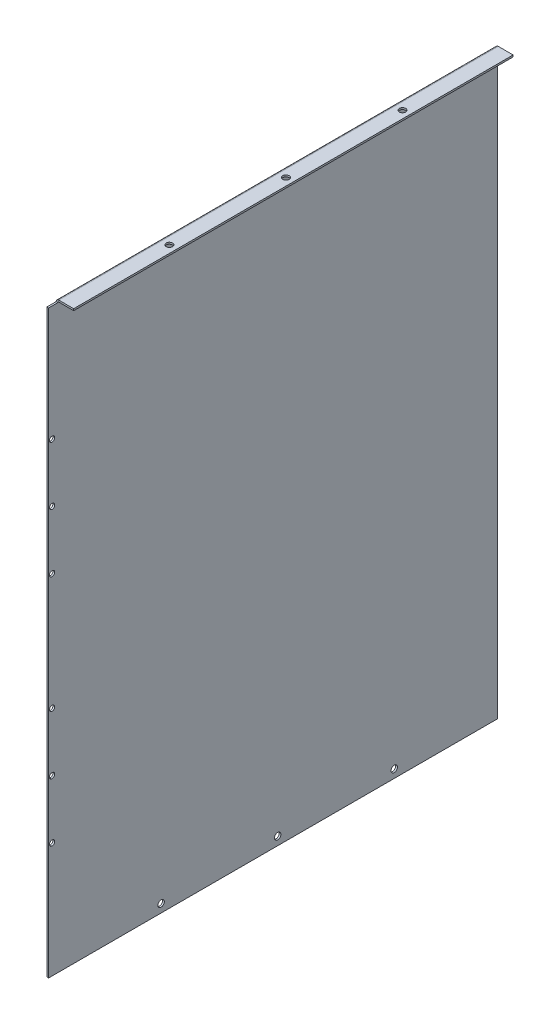
ISO-10303-21;
HEADER;
FILE_DESCRIPTION(('STEP AP214'),'2;1');
FILE_NAME('part.step','',(''),(''),'','','');
FILE_SCHEMA(('AUTOMOTIVE_DESIGN { 1 0 10303 214 1 1 1 1 }'));
ENDSEC;
DATA;
#1=APPLICATION_CONTEXT('core data for automotive mechanical design processes');
#2=APPLICATION_PROTOCOL_DEFINITION('international standard','automotive_design',2000,#1);
#3=PRODUCT_CONTEXT('',#1,'mechanical');
#4=PRODUCT('Part','Part','',(#3));
#5=PRODUCT_RELATED_PRODUCT_CATEGORY('part','',(#4));
#6=PRODUCT_DEFINITION_FORMATION('','',#4);
#7=PRODUCT_DEFINITION_CONTEXT('part definition',#1,'design');
#8=PRODUCT_DEFINITION('design','',#6,#7);
#9=PRODUCT_DEFINITION_SHAPE('','',#8);
#10=(LENGTH_UNIT() NAMED_UNIT(*) SI_UNIT(.MILLI.,.METRE.));
#11=(NAMED_UNIT(*) PLANE_ANGLE_UNIT() SI_UNIT($,.RADIAN.));
#12=(NAMED_UNIT(*) SI_UNIT($,.STERADIAN.) SOLID_ANGLE_UNIT());
#13=UNCERTAINTY_MEASURE_WITH_UNIT(LENGTH_MEASURE(1.E-05),#10,'distance_accuracy_value','');
#14=(GEOMETRIC_REPRESENTATION_CONTEXT(3) GLOBAL_UNCERTAINTY_ASSIGNED_CONTEXT((#13)) GLOBAL_UNIT_ASSIGNED_CONTEXT((#10,
#11,#12)) REPRESENTATION_CONTEXT('',''));
#15=CARTESIAN_POINT('',(0.,0.,0.));
#16=DIRECTION('',(0.,0.,1.));
#17=DIRECTION('',(1.,0.,0.));
#18=AXIS2_PLACEMENT_3D('',#15,#16,#17);
#19=CARTESIAN_POINT('',(0.,0.,377.));
#20=DIRECTION('',(0.,0.,-1.));
#21=DIRECTION('',(-1.,0.,0.));
#22=AXIS2_PLACEMENT_3D('',#19,#20,#21);
#23=PLANE('',#22);
#24=DIRECTION('',(-1.,0.,0.));
#25=VECTOR('',#24,1.);
#26=CARTESIAN_POINT('',(0.,500.,377.));
#27=LINE('',#26,#25);
#28=CARTESIAN_POINT('',(15.,500.,377.));
#29=VERTEX_POINT('',#28);
#30=CARTESIAN_POINT('',(2.23659999999992,500.,377.));
#31=VERTEX_POINT('',#30);
#32=EDGE_CURVE('E152',#29,#31,#27,.T.);
#33=ORIENTED_EDGE('',*,*,#32,.T.);
#34=DIRECTION('',(0.,-1.,0.));
#35=VECTOR('',#34,1.);
#36=CARTESIAN_POINT('',(2.23659999999992,500.,377.));
#37=LINE('',#36,#35);
#38=CARTESIAN_POINT('',(2.23659999999992,498.5,377.));
#39=VERTEX_POINT('',#38);
#40=EDGE_CURVE('E13',#31,#39,#37,.T.);
#41=ORIENTED_EDGE('',*,*,#40,.T.);
#42=DIRECTION('',(-1.,0.,0.));
#43=VECTOR('',#42,1.);
#44=CARTESIAN_POINT('',(0.,498.5,377.));
#45=LINE('',#44,#43);
#46=CARTESIAN_POINT('',(15.,498.5,377.));
#47=VERTEX_POINT('',#46);
#48=EDGE_CURVE('E75',#47,#39,#45,.T.);
#49=ORIENTED_EDGE('',*,*,#48,.F.);
#50=DIRECTION('',(0.,1.,0.));
#51=VECTOR('',#50,1.);
#52=CARTESIAN_POINT('',(15.,500.,377.));
#53=LINE('',#52,#51);
#54=EDGE_CURVE('E68',#47,#29,#53,.T.);
#55=ORIENTED_EDGE('',*,*,#54,.T.);
#56=EDGE_LOOP('',(#33,#41,#49,#55));
#57=FACE_BOUND('',#56,.T.);
#58=ADVANCED_FACE('F59',(#57),#23,.F.);
#59=CARTESIAN_POINT('',(1.5,0.,385.));
#60=DIRECTION('',(-1.,0.,0.));
#61=DIRECTION('',(0.,0.,1.));
#62=AXIS2_PLACEMENT_3D('',#59,#60,#61);
#63=PLANE('',#62);
#64=CARTESIAN_POINT('',(1.5,148.8817,382.));
#65=DIRECTION('',(-1.,0.,0.));
#66=DIRECTION('',(0.,0.,1.));
#67=AXIS2_PLACEMENT_3D('',#64,#65,#66);
#68=CIRCLE('',#67,2.24999999999996);
#69=CARTESIAN_POINT('',(1.5,148.8817,384.25));
#70=VERTEX_POINT('',#69);
#71=EDGE_CURVE('E404',#70,#70,#68,.T.);
#72=ORIENTED_EDGE('',*,*,#71,.T.);
#73=EDGE_LOOP('',(#72));
#74=FACE_BOUND('',#73,.T.);
#75=CARTESIAN_POINT('',(1.5,198.8817,382.));
#76=DIRECTION('',(-1.,0.,0.));
#77=DIRECTION('',(0.,0.,1.));
#78=AXIS2_PLACEMENT_3D('',#75,#76,#77);
#79=CIRCLE('',#78,2.24999999999996);
#80=CARTESIAN_POINT('',(1.5,198.8817,384.25));
#81=VERTEX_POINT('',#80);
#82=EDGE_CURVE('E405',#81,#81,#79,.T.);
#83=ORIENTED_EDGE('',*,*,#82,.T.);
#84=EDGE_LOOP('',(#83));
#85=FACE_BOUND('',#84,.T.);
#86=CARTESIAN_POINT('',(1.5,298.8817,382.));
#87=DIRECTION('',(-1.,0.,0.));
#88=DIRECTION('',(0.,0.,1.));
#89=AXIS2_PLACEMENT_3D('',#86,#87,#88);
#90=CIRCLE('',#89,2.24999999999996);
#91=CARTESIAN_POINT('',(1.5,298.8817,384.25));
#92=VERTEX_POINT('',#91);
#93=EDGE_CURVE('E410',#92,#92,#90,.T.);
#94=ORIENTED_EDGE('',*,*,#93,.T.);
#95=EDGE_LOOP('',(#94));
#96=FACE_BOUND('',#95,.T.);
#97=CARTESIAN_POINT('',(1.5,348.8817,382.));
#98=DIRECTION('',(-1.,0.,0.));
#99=DIRECTION('',(0.,0.,1.));
#100=AXIS2_PLACEMENT_3D('',#97,#98,#99);
#101=CIRCLE('',#100,2.24999999999996);
#102=CARTESIAN_POINT('',(1.5,348.8817,384.25));
#103=VERTEX_POINT('',#102);
#104=EDGE_CURVE('E450',#103,#103,#101,.T.);
#105=ORIENTED_EDGE('',*,*,#104,.T.);
#106=EDGE_LOOP('',(#105));
#107=FACE_BOUND('',#106,.T.);
#108=CARTESIAN_POINT('',(1.5,398.8817,382.));
#109=DIRECTION('',(-1.,0.,0.));
#110=DIRECTION('',(0.,0.,1.));
#111=AXIS2_PLACEMENT_3D('',#108,#109,#110);
#112=CIRCLE('',#111,2.24999999999996);
#113=CARTESIAN_POINT('',(1.5,398.8817,384.25));
#114=VERTEX_POINT('',#113);
#115=EDGE_CURVE('E453',#114,#114,#112,.T.);
#116=ORIENTED_EDGE('',*,*,#115,.T.);
#117=EDGE_LOOP('',(#116));
#118=FACE_BOUND('',#117,.T.);
#119=CARTESIAN_POINT('',(1.5,98.8817,382.));
#120=DIRECTION('',(-1.,0.,0.));
#121=DIRECTION('',(0.,0.,1.));
#122=AXIS2_PLACEMENT_3D('',#119,#120,#121);
#123=CIRCLE('',#122,2.24999999999995);
#124=CARTESIAN_POINT('',(1.5,98.8817,384.25));
#125=VERTEX_POINT('',#124);
#126=EDGE_CURVE('E407',#125,#125,#123,.T.);
#127=ORIENTED_EDGE('',*,*,#126,.T.);
#128=EDGE_LOOP('',(#127));
#129=FACE_BOUND('',#128,.T.);
#130=CARTESIAN_POINT('',(1.5,7.1183000000023,188.5));
#131=DIRECTION('',(1.,0.,0.));
#132=DIRECTION('',(0.,0.,-1.));
#133=AXIS2_PLACEMENT_3D('',#130,#131,#132);
#134=CIRCLE('',#133,2.75000000000001);
#135=CARTESIAN_POINT('',(1.5,7.1183000000023,185.75));
#136=VERTEX_POINT('',#135);
#137=EDGE_CURVE('E132',#136,#136,#134,.T.);
#138=ORIENTED_EDGE('',*,*,#137,.F.);
#139=EDGE_LOOP('',(#138));
#140=FACE_BOUND('',#139,.T.);
#141=CARTESIAN_POINT('',(1.5,7.11830000000231,88.5000000000002));
#142=DIRECTION('',(1.,0.,0.));
#143=DIRECTION('',(0.,0.,-1.));
#144=AXIS2_PLACEMENT_3D('',#141,#142,#143);
#145=CIRCLE('',#144,2.75000000000001);
#146=CARTESIAN_POINT('',(1.5,7.11830000000231,85.7500000000002));
#147=VERTEX_POINT('',#146);
#148=EDGE_CURVE('E137',#147,#147,#145,.T.);
#149=ORIENTED_EDGE('',*,*,#148,.F.);
#150=EDGE_LOOP('',(#149));
#151=FACE_BOUND('',#150,.T.);
#152=CARTESIAN_POINT('',(1.5,7.11830000000231,288.5));
#153=DIRECTION('',(1.,0.,0.));
#154=DIRECTION('',(0.,0.,-1.));
#155=AXIS2_PLACEMENT_3D('',#152,#153,#154);
#156=CIRCLE('',#155,2.75000000000004);
#157=CARTESIAN_POINT('',(1.5,7.11830000000231,285.75));
#158=VERTEX_POINT('',#157);
#159=EDGE_CURVE('E129',#158,#158,#156,.T.);
#160=ORIENTED_EDGE('',*,*,#159,.F.);
#161=EDGE_LOOP('',(#160));
#162=FACE_BOUND('',#161,.T.);
#163=DIRECTION('',(0.,0.,1.));
#164=VECTOR('',#163,1.);
#165=CARTESIAN_POINT('',(1.49999999999995,497.7634,385.));
#166=LINE('',#165,#164);
#167=CARTESIAN_POINT('',(1.49999999999995,497.7634,385.));
#168=VERTEX_POINT('',#167);
#169=CARTESIAN_POINT('',(1.49999999999995,497.7634,377.));
#170=VERTEX_POINT('',#169);
#171=EDGE_CURVE('E197',#168,#170,#166,.F.);
#172=ORIENTED_EDGE('',*,*,#171,.F.);
#173=DIRECTION('',(0.,1.,0.));
#174=VECTOR('',#173,1.);
#175=CARTESIAN_POINT('',(1.5,0.,385.));
#176=LINE('',#175,#174);
#177=CARTESIAN_POINT('',(1.5,0.,385.));
#178=VERTEX_POINT('',#177);
#179=EDGE_CURVE('E102',#178,#168,#176,.T.);
#180=ORIENTED_EDGE('',*,*,#179,.F.);
#181=DIRECTION('',(0.,0.,-1.));
#182=VECTOR('',#181,1.);
#183=CARTESIAN_POINT('',(1.5,0.,385.));
#184=LINE('',#183,#182);
#185=CARTESIAN_POINT('',(1.5,0.,0.));
#186=VERTEX_POINT('',#185);
#187=EDGE_CURVE('E84',#178,#186,#184,.T.);
#188=ORIENTED_EDGE('',*,*,#187,.T.);
#189=DIRECTION('',(0.,1.,0.));
#190=VECTOR('',#189,1.);
#191=CARTESIAN_POINT('',(1.5,0.,0.));
#192=LINE('',#191,#190);
#193=CARTESIAN_POINT('',(1.49999999999995,497.7634,0.));
#194=VERTEX_POINT('',#193);
#195=EDGE_CURVE('E100',#186,#194,#192,.T.);
#196=ORIENTED_EDGE('',*,*,#195,.T.);
#197=EDGE_CURVE('E165',#170,#194,#166,.F.);
#198=ORIENTED_EDGE('',*,*,#197,.F.);
#199=EDGE_LOOP('',(#172,#180,#188,#196,#198));
#200=FACE_BOUND('',#199,.T.);
#201=ADVANCED_FACE('F61',(#74,#85,#96,#107,#118,#129,#140,#151,#162,#200),#63,.F.);
#202=CARTESIAN_POINT('',(0.,0.,385.));
#203=DIRECTION('',(-1.,0.,0.));
#204=DIRECTION('',(0.,0.,1.));
#205=AXIS2_PLACEMENT_3D('',#202,#203,#204);
#206=PLANE('',#205);
#207=CARTESIAN_POINT('',(0.,148.8817,382.));
#208=DIRECTION('',(-1.,0.,0.));
#209=DIRECTION('',(0.,0.,1.));
#210=AXIS2_PLACEMENT_3D('',#207,#208,#209);
#211=CIRCLE('',#210,2.24999999999996);
#212=CARTESIAN_POINT('',(0.,148.8817,384.25));
#213=VERTEX_POINT('',#212);
#214=EDGE_CURVE('E328',#213,#213,#211,.T.);
#215=ORIENTED_EDGE('',*,*,#214,.F.);
#216=EDGE_LOOP('',(#215));
#217=FACE_BOUND('',#216,.T.);
#218=CARTESIAN_POINT('',(0.,198.8817,382.));
#219=DIRECTION('',(-1.,0.,0.));
#220=DIRECTION('',(0.,0.,1.));
#221=AXIS2_PLACEMENT_3D('',#218,#219,#220);
#222=CIRCLE('',#221,2.24999999999996);
#223=CARTESIAN_POINT('',(0.,198.8817,384.25));
#224=VERTEX_POINT('',#223);
#225=EDGE_CURVE('E332',#224,#224,#222,.T.);
#226=ORIENTED_EDGE('',*,*,#225,.F.);
#227=EDGE_LOOP('',(#226));
#228=FACE_BOUND('',#227,.T.);
#229=CARTESIAN_POINT('',(0.,298.8817,382.));
#230=DIRECTION('',(-1.,0.,0.));
#231=DIRECTION('',(0.,0.,-1.));
#232=AXIS2_PLACEMENT_3D('',#229,#230,#231);
#233=CIRCLE('',#232,2.24999999999996);
#234=CARTESIAN_POINT('',(0.,298.8817,379.75));
#235=VERTEX_POINT('',#234);
#236=EDGE_CURVE('E336',#235,#235,#233,.T.);
#237=ORIENTED_EDGE('',*,*,#236,.F.);
#238=EDGE_LOOP('',(#237));
#239=FACE_BOUND('',#238,.T.);
#240=CARTESIAN_POINT('',(0.,348.8817,382.));
#241=DIRECTION('',(-1.,0.,0.));
#242=DIRECTION('',(0.,0.,-1.));
#243=AXIS2_PLACEMENT_3D('',#240,#241,#242);
#244=CIRCLE('',#243,2.24999999999996);
#245=CARTESIAN_POINT('',(0.,348.8817,379.75));
#246=VERTEX_POINT('',#245);
#247=EDGE_CURVE('E340',#246,#246,#244,.T.);
#248=ORIENTED_EDGE('',*,*,#247,.F.);
#249=EDGE_LOOP('',(#248));
#250=FACE_BOUND('',#249,.T.);
#251=CARTESIAN_POINT('',(0.,398.8817,382.));
#252=DIRECTION('',(-1.,0.,0.));
#253=DIRECTION('',(0.,0.,-1.));
#254=AXIS2_PLACEMENT_3D('',#251,#252,#253);
#255=CIRCLE('',#254,2.24999999999996);
#256=CARTESIAN_POINT('',(0.,398.8817,379.75));
#257=VERTEX_POINT('',#256);
#258=EDGE_CURVE('E344',#257,#257,#255,.T.);
#259=ORIENTED_EDGE('',*,*,#258,.F.);
#260=EDGE_LOOP('',(#259));
#261=FACE_BOUND('',#260,.T.);
#262=CARTESIAN_POINT('',(0.,98.8817,382.));
#263=DIRECTION('',(-1.,0.,0.));
#264=DIRECTION('',(0.,0.,1.));
#265=AXIS2_PLACEMENT_3D('',#262,#263,#264);
#266=CIRCLE('',#265,2.24999999999995);
#267=CARTESIAN_POINT('',(0.,98.8817,384.25));
#268=VERTEX_POINT('',#267);
#269=EDGE_CURVE('E348',#268,#268,#266,.T.);
#270=ORIENTED_EDGE('',*,*,#269,.F.);
#271=EDGE_LOOP('',(#270));
#272=FACE_BOUND('',#271,.T.);
#273=CARTESIAN_POINT('',(0.,7.1183000000023,188.5));
#274=DIRECTION('',(-1.,0.,0.));
#275=DIRECTION('',(0.,0.,1.));
#276=AXIS2_PLACEMENT_3D('',#273,#274,#275);
#277=CIRCLE('',#276,2.75000000000001);
#278=CARTESIAN_POINT('',(0.,7.1183000000023,191.25));
#279=VERTEX_POINT('',#278);
#280=EDGE_CURVE('E63',#279,#279,#277,.T.);
#281=ORIENTED_EDGE('',*,*,#280,.F.);
#282=EDGE_LOOP('',(#281));
#283=FACE_BOUND('',#282,.T.);
#284=CARTESIAN_POINT('',(0.,7.11830000000231,88.5000000000002));
#285=DIRECTION('',(-1.,0.,0.));
#286=DIRECTION('',(0.,0.,1.));
#287=AXIS2_PLACEMENT_3D('',#284,#285,#286);
#288=CIRCLE('',#287,2.75000000000001);
#289=CARTESIAN_POINT('',(0.,7.11830000000231,91.2500000000002));
#290=VERTEX_POINT('',#289);
#291=EDGE_CURVE('E130',#290,#290,#288,.T.);
#292=ORIENTED_EDGE('',*,*,#291,.F.);
#293=EDGE_LOOP('',(#292));
#294=FACE_BOUND('',#293,.T.);
#295=CARTESIAN_POINT('',(0.,7.11830000000231,288.5));
#296=DIRECTION('',(-1.,0.,0.));
#297=DIRECTION('',(0.,0.,1.));
#298=AXIS2_PLACEMENT_3D('',#295,#296,#297);
#299=CIRCLE('',#298,2.75000000000004);
#300=CARTESIAN_POINT('',(0.,7.11830000000231,291.25));
#301=VERTEX_POINT('',#300);
#302=EDGE_CURVE('E126',#301,#301,#299,.T.);
#303=ORIENTED_EDGE('',*,*,#302,.F.);
#304=EDGE_LOOP('',(#303));
#305=FACE_BOUND('',#304,.T.);
#306=DIRECTION('',(0.,1.,0.));
#307=VECTOR('',#306,1.);
#308=CARTESIAN_POINT('',(0.,0.,385.));
#309=LINE('',#308,#307);
#310=CARTESIAN_POINT('',(0.,0.,385.));
#311=VERTEX_POINT('',#310);
#312=CARTESIAN_POINT('',(0.,497.7634,385.));
#313=VERTEX_POINT('',#312);
#314=EDGE_CURVE('E120',#311,#313,#309,.T.);
#315=ORIENTED_EDGE('',*,*,#314,.T.);
#316=DIRECTION('',(0.,0.,1.));
#317=VECTOR('',#316,1.);
#318=CARTESIAN_POINT('',(0.,497.7634,385.));
#319=LINE('',#318,#317);
#320=CARTESIAN_POINT('',(0.,497.7634,377.));
#321=VERTEX_POINT('',#320);
#322=EDGE_CURVE('E186',#313,#321,#319,.F.);
#323=ORIENTED_EDGE('',*,*,#322,.T.);
#324=CARTESIAN_POINT('',(0.,497.7634,0.));
#325=VERTEX_POINT('',#324);
#326=EDGE_CURVE('E190',#321,#325,#319,.F.);
#327=ORIENTED_EDGE('',*,*,#326,.T.);
#328=DIRECTION('',(0.,1.,0.));
#329=VECTOR('',#328,1.);
#330=CARTESIAN_POINT('',(0.,0.,0.));
#331=LINE('',#330,#329);
#332=CARTESIAN_POINT('',(0.,0.,0.));
#333=VERTEX_POINT('',#332);
#334=EDGE_CURVE('E115',#333,#325,#331,.T.);
#335=ORIENTED_EDGE('',*,*,#334,.F.);
#336=DIRECTION('',(0.,0.,-1.));
#337=VECTOR('',#336,1.);
#338=CARTESIAN_POINT('',(0.,0.,385.));
#339=LINE('',#338,#337);
#340=EDGE_CURVE('E104',#311,#333,#339,.T.);
#341=ORIENTED_EDGE('',*,*,#340,.F.);
#342=EDGE_LOOP('',(#315,#323,#327,#335,#341));
#343=FACE_BOUND('',#342,.T.);
#344=ADVANCED_FACE('F212',(#217,#228,#239,#250,#261,#272,#283,#294,#305,#343),#206,.T.);
#345=CARTESIAN_POINT('',(0.,0.,385.));
#346=DIRECTION('',(0.,0.,-1.));
#347=DIRECTION('',(-1.,0.,0.));
#348=AXIS2_PLACEMENT_3D('',#345,#346,#347);
#349=PLANE('',#348);
#350=DIRECTION('',(-1.,0.,0.));
#351=VECTOR('',#350,1.);
#352=CARTESIAN_POINT('',(1.49999999999995,497.7634,385.));
#353=LINE('',#352,#351);
#354=EDGE_CURVE('E193',#168,#313,#353,.T.);
#355=ORIENTED_EDGE('',*,*,#354,.T.);
#356=ORIENTED_EDGE('',*,*,#314,.F.);
#357=DIRECTION('',(-1.,0.,0.));
#358=VECTOR('',#357,1.);
#359=CARTESIAN_POINT('',(1.5,0.,385.));
#360=LINE('',#359,#358);
#361=EDGE_CURVE('E105',#178,#311,#360,.T.);
#362=ORIENTED_EDGE('',*,*,#361,.F.);
#363=ORIENTED_EDGE('',*,*,#179,.T.);
#364=EDGE_LOOP('',(#355,#356,#362,#363));
#365=FACE_BOUND('',#364,.T.);
#366=ADVANCED_FACE('F207',(#365),#349,.F.);
#367=CARTESIAN_POINT('',(1.5,0.,385.));
#368=DIRECTION('',(0.,-1.,0.));
#369=DIRECTION('',(0.,0.,-1.));
#370=AXIS2_PLACEMENT_3D('',#367,#368,#369);
#371=PLANE('',#370);
#372=DIRECTION('',(-1.,0.,0.));
#373=VECTOR('',#372,1.);
#374=CARTESIAN_POINT('',(1.5,0.,0.));
#375=LINE('',#374,#373);
#376=EDGE_CURVE('E112',#186,#333,#375,.T.);
#377=ORIENTED_EDGE('',*,*,#376,.F.);
#378=ORIENTED_EDGE('',*,*,#187,.F.);
#379=ORIENTED_EDGE('',*,*,#361,.T.);
#380=ORIENTED_EDGE('',*,*,#340,.T.);
#381=EDGE_LOOP('',(#377,#378,#379,#380));
#382=FACE_BOUND('',#381,.T.);
#383=ADVANCED_FACE('F117',(#382),#371,.T.);
#384=CARTESIAN_POINT('',(0.,0.,0.));
#385=DIRECTION('',(0.,0.,-1.));
#386=DIRECTION('',(-1.,0.,0.));
#387=AXIS2_PLACEMENT_3D('',#384,#385,#386);
#388=PLANE('',#387);
#389=DIRECTION('',(-1.,0.,0.));
#390=VECTOR('',#389,1.);
#391=CARTESIAN_POINT('',(1.49999999999995,497.7634,0.));
#392=LINE('',#391,#390);
#393=EDGE_CURVE('E114',#194,#325,#392,.T.);
#394=ORIENTED_EDGE('',*,*,#393,.F.);
#395=ORIENTED_EDGE('',*,*,#195,.F.);
#396=ORIENTED_EDGE('',*,*,#376,.T.);
#397=ORIENTED_EDGE('',*,*,#334,.T.);
#398=EDGE_LOOP('',(#394,#395,#396,#397));
#399=FACE_BOUND('',#398,.T.);
#400=ADVANCED_FACE('F110',(#399),#388,.T.);
#401=CARTESIAN_POINT('',(2.23659999999992,497.7634,0.));
#402=DIRECTION('',(0.,0.,-1.));
#403=DIRECTION('',(-1.,0.,0.));
#404=AXIS2_PLACEMENT_3D('',#401,#402,#403);
#405=PLANE('',#404);
#406=DIRECTION('',(0.,1.,0.));
#407=VECTOR('',#406,1.);
#408=CARTESIAN_POINT('',(2.23659999999992,500.,0.));
#409=LINE('',#408,#407);
#410=CARTESIAN_POINT('',(2.23659999999992,498.5,0.));
#411=VERTEX_POINT('',#410);
#412=CARTESIAN_POINT('',(2.23659999999992,500.,0.));
#413=VERTEX_POINT('',#412);
#414=EDGE_CURVE('E161',#411,#413,#409,.T.);
#415=ORIENTED_EDGE('',*,*,#414,.F.);
#416=CARTESIAN_POINT('',(2.23659999999992,497.7634,0.));
#417=DIRECTION('',(0.,0.,1.));
#418=DIRECTION('',(1.,0.,0.));
#419=AXIS2_PLACEMENT_3D('',#416,#417,#418);
#420=CIRCLE('',#419,0.736599999999976);
#421=EDGE_CURVE('E194',#194,#411,#420,.F.);
#422=ORIENTED_EDGE('',*,*,#421,.F.);
#423=ORIENTED_EDGE('',*,*,#393,.T.);
#424=CARTESIAN_POINT('',(2.23659999999992,497.7634,0.));
#425=DIRECTION('',(0.,0.,1.));
#426=DIRECTION('',(1.,0.,0.));
#427=AXIS2_PLACEMENT_3D('',#424,#425,#426);
#428=CIRCLE('',#427,2.23659999999998);
#429=EDGE_CURVE('E189',#325,#413,#428,.F.);
#430=ORIENTED_EDGE('',*,*,#429,.T.);
#431=EDGE_LOOP('',(#415,#422,#423,#430));
#432=FACE_BOUND('',#431,.T.);
#433=ADVANCED_FACE('F249',(#432),#405,.T.);
#434=CARTESIAN_POINT('',(2.23659999999992,497.7634,385.));
#435=DIRECTION('',(0.,0.,1.));
#436=DIRECTION('',(0.,1.,0.));
#437=AXIS2_PLACEMENT_3D('',#434,#435,#436);
#438=CYLINDRICAL_SURFACE('',#437,2.23659999999998);
#439=CARTESIAN_POINT('',(2.23659999999992,497.7634,377.));
#440=DIRECTION('',(0.,0.,-1.));
#441=DIRECTION('',(-1.,0.,0.));
#442=AXIS2_PLACEMENT_3D('',#439,#440,#441);
#443=CIRCLE('',#442,2.23659999999998);
#444=EDGE_CURVE('E158',#31,#321,#443,.F.);
#445=ORIENTED_EDGE('',*,*,#444,.F.);
#446=DIRECTION('',(0.,0.,1.));
#447=VECTOR('',#446,1.);
#448=CARTESIAN_POINT('',(2.23659999999992,500.,0.));
#449=LINE('',#448,#447);
#450=EDGE_CURVE('E178',#413,#31,#449,.T.);
#451=ORIENTED_EDGE('',*,*,#450,.F.);
#452=ORIENTED_EDGE('',*,*,#429,.F.);
#453=ORIENTED_EDGE('',*,*,#326,.F.);
#454=EDGE_LOOP('',(#445,#451,#452,#453));
#455=FACE_BOUND('',#454,.T.);
#456=ADVANCED_FACE('F246',(#455),#438,.T.);
#457=CARTESIAN_POINT('',(2.23659999999992,497.7634,385.));
#458=DIRECTION('',(0.,0.,1.));
#459=DIRECTION('',(0.,1.,0.));
#460=AXIS2_PLACEMENT_3D('',#457,#458,#459);
#461=CYLINDRICAL_SURFACE('',#460,0.736599999999976);
#462=DIRECTION('',(0.,0.,-1.));
#463=VECTOR('',#462,1.);
#464=CARTESIAN_POINT('',(2.23659999999992,498.5,0.));
#465=LINE('',#464,#463);
#466=EDGE_CURVE('E181',#411,#39,#465,.F.);
#467=ORIENTED_EDGE('',*,*,#466,.T.);
#468=CARTESIAN_POINT('',(2.23659999999992,497.7634,377.));
#469=DIRECTION('',(0.,0.,-1.));
#470=DIRECTION('',(-1.,0.,0.));
#471=AXIS2_PLACEMENT_3D('',#468,#469,#470);
#472=CIRCLE('',#471,0.736599999999976);
#473=EDGE_CURVE('E155',#39,#170,#472,.F.);
#474=ORIENTED_EDGE('',*,*,#473,.T.);
#475=ORIENTED_EDGE('',*,*,#197,.T.);
#476=ORIENTED_EDGE('',*,*,#421,.T.);
#477=EDGE_LOOP('',(#467,#474,#475,#476));
#478=FACE_BOUND('',#477,.T.);
#479=ADVANCED_FACE('F252',(#478),#461,.F.);
#480=CARTESIAN_POINT('',(15.,500.,-1.11022302462516E-13));
#481=DIRECTION('',(0.,0.,-1.));
#482=DIRECTION('',(-1.,0.,0.));
#483=AXIS2_PLACEMENT_3D('',#480,#481,#482);
#484=PLANE('',#483);
#485=DIRECTION('',(-1.,0.,0.));
#486=VECTOR('',#485,1.);
#487=CARTESIAN_POINT('',(0.,498.5,0.));
#488=LINE('',#487,#486);
#489=CARTESIAN_POINT('',(15.,498.5,-1.11022302462516E-13));
#490=VERTEX_POINT('',#489);
#491=EDGE_CURVE('E175',#411,#490,#488,.F.);
#492=ORIENTED_EDGE('',*,*,#491,.F.);
#493=ORIENTED_EDGE('',*,*,#414,.T.);
#494=DIRECTION('',(1.,0.,0.));
#495=VECTOR('',#494,1.);
#496=CARTESIAN_POINT('',(15.,500.,-1.11022302462516E-13));
#497=LINE('',#496,#495);
#498=CARTESIAN_POINT('',(15.,500.,-1.11022302462516E-13));
#499=VERTEX_POINT('',#498);
#500=EDGE_CURVE('E169',#413,#499,#497,.T.);
#501=ORIENTED_EDGE('',*,*,#500,.T.);
#502=DIRECTION('',(0.,-1.,0.));
#503=VECTOR('',#502,1.);
#504=CARTESIAN_POINT('',(15.,500.,-1.11022302462516E-13));
#505=LINE('',#504,#503);
#506=EDGE_CURVE('E162',#499,#490,#505,.T.);
#507=ORIENTED_EDGE('',*,*,#506,.T.);
#508=EDGE_LOOP('',(#492,#493,#501,#507));
#509=FACE_BOUND('',#508,.T.);
#510=ADVANCED_FACE('F257',(#509),#484,.T.);
#511=CARTESIAN_POINT('',(0.,500.,0.));
#512=DIRECTION('',(0.,1.,0.));
#513=DIRECTION('',(0.,0.,1.));
#514=AXIS2_PLACEMENT_3D('',#511,#512,#513);
#515=PLANE('',#514);
#516=CARTESIAN_POINT('',(8.61829999999996,500.,188.5));
#517=DIRECTION('',(0.,1.,0.));
#518=DIRECTION('',(0.,0.,1.));
#519=AXIS2_PLACEMENT_3D('',#516,#517,#518);
#520=CIRCLE('',#519,2.75);
#521=CARTESIAN_POINT('',(8.61829999999996,500.,191.25));
#522=VERTEX_POINT('',#521);
#523=EDGE_CURVE('E425',#522,#522,#520,.T.);
#524=ORIENTED_EDGE('',*,*,#523,.F.);
#525=EDGE_LOOP('',(#524));
#526=FACE_BOUND('',#525,.T.);
#527=CARTESIAN_POINT('',(8.6183,500.,288.5));
#528=DIRECTION('',(0.,1.,0.));
#529=DIRECTION('',(0.,0.,1.));
#530=AXIS2_PLACEMENT_3D('',#527,#528,#529);
#531=CIRCLE('',#530,2.75);
#532=CARTESIAN_POINT('',(8.6183,500.,291.25));
#533=VERTEX_POINT('',#532);
#534=EDGE_CURVE('E420',#533,#533,#531,.T.);
#535=ORIENTED_EDGE('',*,*,#534,.F.);
#536=EDGE_LOOP('',(#535));
#537=FACE_BOUND('',#536,.T.);
#538=CARTESIAN_POINT('',(8.6183,500.,88.5));
#539=DIRECTION('',(0.,1.,0.));
#540=DIRECTION('',(0.,0.,1.));
#541=AXIS2_PLACEMENT_3D('',#538,#539,#540);
#542=CIRCLE('',#541,2.75);
#543=CARTESIAN_POINT('',(8.6183,500.,91.25));
#544=VERTEX_POINT('',#543);
#545=EDGE_CURVE('E142',#544,#544,#542,.T.);
#546=ORIENTED_EDGE('',*,*,#545,.F.);
#547=EDGE_LOOP('',(#546));
#548=FACE_BOUND('',#547,.T.);
#549=ORIENTED_EDGE('',*,*,#32,.F.);
#550=DIRECTION('',(0.,0.,1.));
#551=VECTOR('',#550,1.);
#552=CARTESIAN_POINT('',(15.,500.,385.));
#553=LINE('',#552,#551);
#554=EDGE_CURVE('E166',#499,#29,#553,.T.);
#555=ORIENTED_EDGE('',*,*,#554,.F.);
#556=ORIENTED_EDGE('',*,*,#500,.F.);
#557=ORIENTED_EDGE('',*,*,#450,.T.);
#558=EDGE_LOOP('',(#549,#555,#556,#557));
#559=FACE_BOUND('',#558,.T.);
#560=ADVANCED_FACE('F266',(#526,#537,#548,#559),#515,.T.);
#561=CARTESIAN_POINT('',(0.,498.5,0.));
#562=DIRECTION('',(0.,1.,0.));
#563=DIRECTION('',(0.,0.,1.));
#564=AXIS2_PLACEMENT_3D('',#561,#562,#563);
#565=PLANE('',#564);
#566=CARTESIAN_POINT('',(8.61829999999996,498.5,188.5));
#567=DIRECTION('',(0.,-1.,0.));
#568=DIRECTION('',(0.,0.,-1.));
#569=AXIS2_PLACEMENT_3D('',#566,#567,#568);
#570=CIRCLE('',#569,2.75);
#571=CARTESIAN_POINT('',(8.61829999999996,498.5,185.75));
#572=VERTEX_POINT('',#571);
#573=EDGE_CURVE('E417',#572,#572,#570,.T.);
#574=ORIENTED_EDGE('',*,*,#573,.F.);
#575=EDGE_LOOP('',(#574));
#576=FACE_BOUND('',#575,.T.);
#577=CARTESIAN_POINT('',(8.6183,498.5,288.5));
#578=DIRECTION('',(0.,-1.,0.));
#579=DIRECTION('',(0.,0.,1.));
#580=AXIS2_PLACEMENT_3D('',#577,#578,#579);
#581=CIRCLE('',#580,2.75);
#582=CARTESIAN_POINT('',(8.6183,498.5,291.25));
#583=VERTEX_POINT('',#582);
#584=EDGE_CURVE('E416',#583,#583,#581,.T.);
#585=ORIENTED_EDGE('',*,*,#584,.F.);
#586=EDGE_LOOP('',(#585));
#587=FACE_BOUND('',#586,.T.);
#588=CARTESIAN_POINT('',(8.6183,498.5,88.5));
#589=DIRECTION('',(0.,-1.,0.));
#590=DIRECTION('',(0.,0.,-1.));
#591=AXIS2_PLACEMENT_3D('',#588,#589,#590);
#592=CIRCLE('',#591,2.75);
#593=CARTESIAN_POINT('',(8.6183,498.5,85.75));
#594=VERTEX_POINT('',#593);
#595=EDGE_CURVE('E427',#594,#594,#592,.T.);
#596=ORIENTED_EDGE('',*,*,#595,.F.);
#597=EDGE_LOOP('',(#596));
#598=FACE_BOUND('',#597,.T.);
#599=DIRECTION('',(0.,0.,-1.));
#600=VECTOR('',#599,1.);
#601=CARTESIAN_POINT('',(15.,498.5,0.));
#602=LINE('',#601,#600);
#603=EDGE_CURVE('E172',#490,#47,#602,.F.);
#604=ORIENTED_EDGE('',*,*,#603,.T.);
#605=ORIENTED_EDGE('',*,*,#48,.T.);
#606=ORIENTED_EDGE('',*,*,#466,.F.);
#607=ORIENTED_EDGE('',*,*,#491,.T.);
#608=EDGE_LOOP('',(#604,#605,#606,#607));
#609=FACE_BOUND('',#608,.T.);
#610=ADVANCED_FACE('F255',(#576,#587,#598,#609),#565,.F.);
#611=CARTESIAN_POINT('',(15.,500.,385.));
#612=DIRECTION('',(1.,0.,0.));
#613=DIRECTION('',(0.,1.,0.));
#614=AXIS2_PLACEMENT_3D('',#611,#612,#613);
#615=PLANE('',#614);
#616=ORIENTED_EDGE('',*,*,#54,.F.);
#617=ORIENTED_EDGE('',*,*,#603,.F.);
#618=ORIENTED_EDGE('',*,*,#506,.F.);
#619=ORIENTED_EDGE('',*,*,#554,.T.);
#620=EDGE_LOOP('',(#616,#617,#618,#619));
#621=FACE_BOUND('',#620,.T.);
#622=ADVANCED_FACE('F263',(#621),#615,.T.);
#623=CARTESIAN_POINT('',(0.,497.7634,377.));
#624=DIRECTION('',(0.,-1.,0.));
#625=DIRECTION('',(0.,0.,-1.));
#626=AXIS2_PLACEMENT_3D('',#623,#624,#625);
#627=PLANE('',#626);
#628=DIRECTION('',(1.,0.,0.));
#629=VECTOR('',#628,1.);
#630=CARTESIAN_POINT('',(0.,497.7634,377.));
#631=LINE('',#630,#629);
#632=EDGE_CURVE('E128',#321,#170,#631,.T.);
#633=ORIENTED_EDGE('',*,*,#632,.F.);
#634=ORIENTED_EDGE('',*,*,#322,.F.);
#635=ORIENTED_EDGE('',*,*,#354,.F.);
#636=ORIENTED_EDGE('',*,*,#171,.T.);
#637=EDGE_LOOP('',(#633,#634,#635,#636));
#638=FACE_BOUND('',#637,.T.);
#639=ADVANCED_FACE('F292',(#638),#627,.F.);
#640=ORIENTED_EDGE('',*,*,#40,.F.);
#641=ORIENTED_EDGE('',*,*,#444,.T.);
#642=ORIENTED_EDGE('',*,*,#632,.T.);
#643=ORIENTED_EDGE('',*,*,#473,.F.);
#644=EDGE_LOOP('',(#640,#641,#642,#643));
#645=FACE_BOUND('',#644,.T.);
#646=ADVANCED_FACE('F283',(#645),#23,.F.);
#647=CARTESIAN_POINT('',(-18.5,7.11830000000231,288.5));
#648=DIRECTION('',(1.,0.,0.));
#649=DIRECTION('',(0.,0.,-1.));
#650=AXIS2_PLACEMENT_3D('',#647,#648,#649);
#651=CYLINDRICAL_SURFACE('',#650,2.75000000000004);
#652=ORIENTED_EDGE('',*,*,#302,.T.);
#653=EDGE_LOOP('',(#652));
#654=FACE_BOUND('',#653,.T.);
#655=ORIENTED_EDGE('',*,*,#159,.T.);
#656=EDGE_LOOP('',(#655));
#657=FACE_BOUND('',#656,.T.);
#658=ADVANCED_FACE('F291',(#654,#657),#651,.F.);
#659=CARTESIAN_POINT('',(-18.5,7.11830000000231,88.5000000000002));
#660=DIRECTION('',(1.,0.,0.));
#661=DIRECTION('',(0.,0.,-1.));
#662=AXIS2_PLACEMENT_3D('',#659,#660,#661);
#663=CYLINDRICAL_SURFACE('',#662,2.75000000000001);
#664=ORIENTED_EDGE('',*,*,#291,.T.);
#665=EDGE_LOOP('',(#664));
#666=FACE_BOUND('',#665,.T.);
#667=ORIENTED_EDGE('',*,*,#148,.T.);
#668=EDGE_LOOP('',(#667));
#669=FACE_BOUND('',#668,.T.);
#670=ADVANCED_FACE('F298',(#666,#669),#663,.F.);
#671=CARTESIAN_POINT('',(-18.5,7.1183000000023,188.5));
#672=DIRECTION('',(1.,0.,0.));
#673=DIRECTION('',(0.,0.,-1.));
#674=AXIS2_PLACEMENT_3D('',#671,#672,#673);
#675=CYLINDRICAL_SURFACE('',#674,2.75000000000001);
#676=ORIENTED_EDGE('',*,*,#280,.T.);
#677=EDGE_LOOP('',(#676));
#678=FACE_BOUND('',#677,.T.);
#679=ORIENTED_EDGE('',*,*,#137,.T.);
#680=EDGE_LOOP('',(#679));
#681=FACE_BOUND('',#680,.T.);
#682=ADVANCED_FACE('F357',(#678,#681),#675,.F.);
#683=CARTESIAN_POINT('',(8.6183,508.5,88.5));
#684=DIRECTION('',(0.,-1.,0.));
#685=DIRECTION('',(0.,0.,-1.));
#686=AXIS2_PLACEMENT_3D('',#683,#684,#685);
#687=CYLINDRICAL_SURFACE('',#686,2.75);
#688=ORIENTED_EDGE('',*,*,#545,.T.);
#689=EDGE_LOOP('',(#688));
#690=FACE_BOUND('',#689,.T.);
#691=ORIENTED_EDGE('',*,*,#595,.T.);
#692=EDGE_LOOP('',(#691));
#693=FACE_BOUND('',#692,.T.);
#694=ADVANCED_FACE('F359',(#690,#693),#687,.F.);
#695=CARTESIAN_POINT('',(8.6183,508.5,288.5));
#696=DIRECTION('',(0.,-1.,0.));
#697=DIRECTION('',(0.,0.,-1.));
#698=AXIS2_PLACEMENT_3D('',#695,#696,#697);
#699=CYLINDRICAL_SURFACE('',#698,2.75);
#700=ORIENTED_EDGE('',*,*,#534,.T.);
#701=EDGE_LOOP('',(#700));
#702=FACE_BOUND('',#701,.T.);
#703=ORIENTED_EDGE('',*,*,#584,.T.);
#704=EDGE_LOOP('',(#703));
#705=FACE_BOUND('',#704,.T.);
#706=ADVANCED_FACE('F364',(#702,#705),#699,.F.);
#707=CARTESIAN_POINT('',(8.61829999999996,508.5,188.5));
#708=DIRECTION('',(0.,-1.,0.));
#709=DIRECTION('',(0.,0.,-1.));
#710=AXIS2_PLACEMENT_3D('',#707,#708,#709);
#711=CYLINDRICAL_SURFACE('',#710,2.75);
#712=ORIENTED_EDGE('',*,*,#523,.T.);
#713=EDGE_LOOP('',(#712));
#714=FACE_BOUND('',#713,.T.);
#715=ORIENTED_EDGE('',*,*,#573,.T.);
#716=EDGE_LOOP('',(#715));
#717=FACE_BOUND('',#716,.T.);
#718=ADVANCED_FACE('F371',(#714,#717),#711,.F.);
#719=CARTESIAN_POINT('',(10.,98.8817,382.));
#720=DIRECTION('',(-1.,0.,0.));
#721=DIRECTION('',(0.,0.,1.));
#722=AXIS2_PLACEMENT_3D('',#719,#720,#721);
#723=CYLINDRICAL_SURFACE('',#722,2.24999999999995);
#724=ORIENTED_EDGE('',*,*,#269,.T.);
#725=EDGE_LOOP('',(#724));
#726=FACE_BOUND('',#725,.T.);
#727=ORIENTED_EDGE('',*,*,#126,.F.);
#728=EDGE_LOOP('',(#727));
#729=FACE_BOUND('',#728,.T.);
#730=ADVANCED_FACE('F375',(#726,#729),#723,.F.);
#731=CARTESIAN_POINT('',(10.,398.8817,382.));
#732=DIRECTION('',(-1.,0.,0.));
#733=DIRECTION('',(0.,0.,1.));
#734=AXIS2_PLACEMENT_3D('',#731,#732,#733);
#735=CYLINDRICAL_SURFACE('',#734,2.24999999999996);
#736=ORIENTED_EDGE('',*,*,#258,.T.);
#737=EDGE_LOOP('',(#736));
#738=FACE_BOUND('',#737,.T.);
#739=ORIENTED_EDGE('',*,*,#115,.F.);
#740=EDGE_LOOP('',(#739));
#741=FACE_BOUND('',#740,.T.);
#742=ADVANCED_FACE('F379',(#738,#741),#735,.F.);
#743=CARTESIAN_POINT('',(10.,348.8817,382.));
#744=DIRECTION('',(-1.,0.,0.));
#745=DIRECTION('',(0.,0.,1.));
#746=AXIS2_PLACEMENT_3D('',#743,#744,#745);
#747=CYLINDRICAL_SURFACE('',#746,2.24999999999996);
#748=ORIENTED_EDGE('',*,*,#247,.T.);
#749=EDGE_LOOP('',(#748));
#750=FACE_BOUND('',#749,.T.);
#751=ORIENTED_EDGE('',*,*,#104,.F.);
#752=EDGE_LOOP('',(#751));
#753=FACE_BOUND('',#752,.T.);
#754=ADVANCED_FACE('F383',(#750,#753),#747,.F.);
#755=CARTESIAN_POINT('',(10.,298.8817,382.));
#756=DIRECTION('',(-1.,0.,0.));
#757=DIRECTION('',(0.,0.,1.));
#758=AXIS2_PLACEMENT_3D('',#755,#756,#757);
#759=CYLINDRICAL_SURFACE('',#758,2.24999999999996);
#760=ORIENTED_EDGE('',*,*,#236,.T.);
#761=EDGE_LOOP('',(#760));
#762=FACE_BOUND('',#761,.T.);
#763=ORIENTED_EDGE('',*,*,#93,.F.);
#764=EDGE_LOOP('',(#763));
#765=FACE_BOUND('',#764,.T.);
#766=ADVANCED_FACE('F387',(#762,#765),#759,.F.);
#767=CARTESIAN_POINT('',(10.,198.8817,382.));
#768=DIRECTION('',(-1.,0.,0.));
#769=DIRECTION('',(0.,0.,1.));
#770=AXIS2_PLACEMENT_3D('',#767,#768,#769);
#771=CYLINDRICAL_SURFACE('',#770,2.24999999999996);
#772=ORIENTED_EDGE('',*,*,#225,.T.);
#773=EDGE_LOOP('',(#772));
#774=FACE_BOUND('',#773,.T.);
#775=ORIENTED_EDGE('',*,*,#82,.F.);
#776=EDGE_LOOP('',(#775));
#777=FACE_BOUND('',#776,.T.);
#778=ADVANCED_FACE('F391',(#774,#777),#771,.F.);
#779=CARTESIAN_POINT('',(10.,148.8817,382.));
#780=DIRECTION('',(-1.,0.,0.));
#781=DIRECTION('',(0.,0.,1.));
#782=AXIS2_PLACEMENT_3D('',#779,#780,#781);
#783=CYLINDRICAL_SURFACE('',#782,2.24999999999996);
#784=ORIENTED_EDGE('',*,*,#214,.T.);
#785=EDGE_LOOP('',(#784));
#786=FACE_BOUND('',#785,.T.);
#787=ORIENTED_EDGE('',*,*,#71,.F.);
#788=EDGE_LOOP('',(#787));
#789=FACE_BOUND('',#788,.T.);
#790=ADVANCED_FACE('F395',(#786,#789),#783,.F.);
#791=CLOSED_SHELL('',(#58,#201,#344,#366,#383,#400,#433,#456,#479,#510,#560,#610,#622,#639,#646,
#658,#670,#682,#694,#706,#718,#730,#742,#754,#766,#778,#790));
#792=MANIFOLD_SOLID_BREP('B2',#791);
#793=ADVANCED_BREP_SHAPE_REPRESENTATION('',(#18,#792),#14);
#794=SHAPE_DEFINITION_REPRESENTATION(#9,#793);
ENDSEC;
END-ISO-10303-21;
